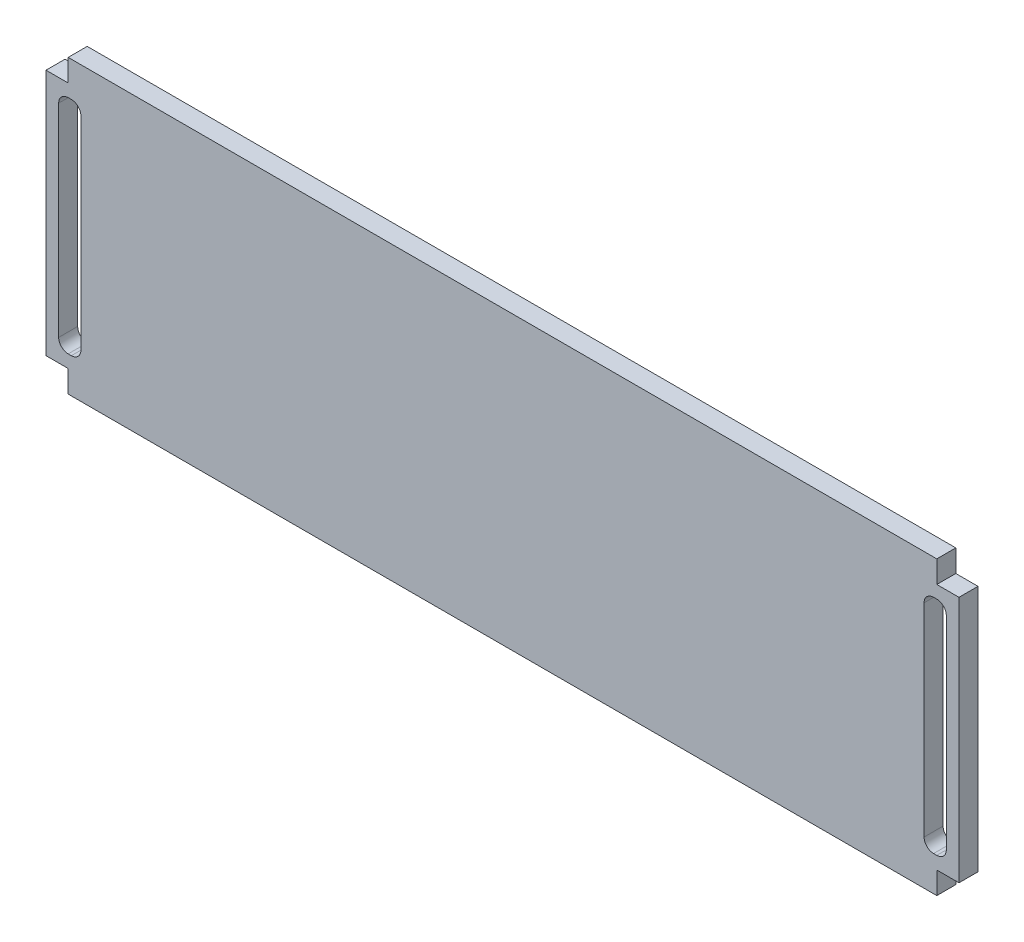
ISO-10303-21;
HEADER;
FILE_DESCRIPTION(('STEP AP214'),'2;1');
FILE_NAME('part.step','',(''),(''),'','','');
FILE_SCHEMA(('AUTOMOTIVE_DESIGN { 1 0 10303 214 1 1 1 1 }'));
ENDSEC;
DATA;
#1=APPLICATION_CONTEXT('core data for automotive mechanical design processes');
#2=APPLICATION_PROTOCOL_DEFINITION('international standard','automotive_design',2000,#1);
#3=PRODUCT_CONTEXT('',#1,'mechanical');
#4=PRODUCT('Part','Part','',(#3));
#5=PRODUCT_RELATED_PRODUCT_CATEGORY('part','',(#4));
#6=PRODUCT_DEFINITION_FORMATION('','',#4);
#7=PRODUCT_DEFINITION_CONTEXT('part definition',#1,'design');
#8=PRODUCT_DEFINITION('design','',#6,#7);
#9=PRODUCT_DEFINITION_SHAPE('','',#8);
#10=(LENGTH_UNIT() NAMED_UNIT(*) SI_UNIT(.MILLI.,.METRE.));
#11=(NAMED_UNIT(*) PLANE_ANGLE_UNIT() SI_UNIT($,.RADIAN.));
#12=(NAMED_UNIT(*) SI_UNIT($,.STERADIAN.) SOLID_ANGLE_UNIT());
#13=UNCERTAINTY_MEASURE_WITH_UNIT(LENGTH_MEASURE(1.E-05),#10,'distance_accuracy_value','');
#14=(GEOMETRIC_REPRESENTATION_CONTEXT(3) GLOBAL_UNCERTAINTY_ASSIGNED_CONTEXT((#13)) GLOBAL_UNIT_ASSIGNED_CONTEXT((#10,
#11,#12)) REPRESENTATION_CONTEXT('',''));
#15=CARTESIAN_POINT('',(0.,0.,0.));
#16=DIRECTION('',(0.,0.,1.));
#17=DIRECTION('',(1.,0.,0.));
#18=AXIS2_PLACEMENT_3D('',#15,#16,#17);
#19=CARTESIAN_POINT('',(72.,3.5,3.));
#20=DIRECTION('',(0.,1.,0.));
#21=DIRECTION('',(0.,0.,1.));
#22=AXIS2_PLACEMENT_3D('',#19,#20,#21);
#23=PLANE('',#22);
#24=DIRECTION('',(1.,0.,0.));
#25=VECTOR('',#24,1.);
#26=CARTESIAN_POINT('',(72.,3.5,0.));
#27=LINE('',#26,#25);
#28=CARTESIAN_POINT('',(68.5,3.5,0.));
#29=VERTEX_POINT('',#28);
#30=CARTESIAN_POINT('',(72.,3.5,0.));
#31=VERTEX_POINT('',#30);
#32=EDGE_CURVE('E247',#29,#31,#27,.T.);
#33=ORIENTED_EDGE('',*,*,#32,.T.);
#34=DIRECTION('',(0.,0.,-1.));
#35=VECTOR('',#34,1.);
#36=CARTESIAN_POINT('',(72.,3.5,3.));
#37=LINE('',#36,#35);
#38=CARTESIAN_POINT('',(72.,3.5,3.));
#39=VERTEX_POINT('',#38);
#40=EDGE_CURVE('E228',#39,#31,#37,.T.);
#41=ORIENTED_EDGE('',*,*,#40,.F.);
#42=DIRECTION('',(1.,0.,0.));
#43=VECTOR('',#42,1.);
#44=CARTESIAN_POINT('',(72.,3.5,3.));
#45=LINE('',#44,#43);
#46=CARTESIAN_POINT('',(68.5,3.5,3.));
#47=VERTEX_POINT('',#46);
#48=EDGE_CURVE('E235',#47,#39,#45,.T.);
#49=ORIENTED_EDGE('',*,*,#48,.F.);
#50=DIRECTION('',(0.,0.,-1.));
#51=VECTOR('',#50,1.);
#52=CARTESIAN_POINT('',(68.5,3.5,3.));
#53=LINE('',#52,#51);
#54=EDGE_CURVE('E370',#47,#29,#53,.T.);
#55=ORIENTED_EDGE('',*,*,#54,.T.);
#56=EDGE_LOOP('',(#33,#41,#49,#55));
#57=FACE_BOUND('',#56,.T.);
#58=ADVANCED_FACE('F39',(#57),#23,.F.);
#59=CARTESIAN_POINT('',(72.,42.5,3.));
#60=DIRECTION('',(-1.,0.,0.));
#61=DIRECTION('',(0.,-1.,0.));
#62=AXIS2_PLACEMENT_3D('',#59,#60,#61);
#63=PLANE('',#62);
#64=DIRECTION('',(0.,1.,0.));
#65=VECTOR('',#64,1.);
#66=CARTESIAN_POINT('',(72.,42.5,0.));
#67=LINE('',#66,#65);
#68=CARTESIAN_POINT('',(72.,42.5,0.));
#69=VERTEX_POINT('',#68);
#70=EDGE_CURVE('E372',#31,#69,#67,.T.);
#71=ORIENTED_EDGE('',*,*,#70,.T.);
#72=DIRECTION('',(0.,0.,-1.));
#73=VECTOR('',#72,1.);
#74=CARTESIAN_POINT('',(72.,42.5,3.));
#75=LINE('',#74,#73);
#76=CARTESIAN_POINT('',(72.,42.5,3.));
#77=VERTEX_POINT('',#76);
#78=EDGE_CURVE('E231',#77,#69,#75,.T.);
#79=ORIENTED_EDGE('',*,*,#78,.F.);
#80=DIRECTION('',(0.,1.,0.));
#81=VECTOR('',#80,1.);
#82=CARTESIAN_POINT('',(72.,42.5,3.));
#83=LINE('',#82,#81);
#84=EDGE_CURVE('E224',#39,#77,#83,.T.);
#85=ORIENTED_EDGE('',*,*,#84,.F.);
#86=ORIENTED_EDGE('',*,*,#40,.T.);
#87=EDGE_LOOP('',(#71,#79,#85,#86));
#88=FACE_BOUND('',#87,.T.);
#89=ADVANCED_FACE('F226',(#88),#63,.F.);
#90=CARTESIAN_POINT('',(68.5,42.5,3.));
#91=DIRECTION('',(0.,-1.,0.));
#92=DIRECTION('',(0.,0.,-1.));
#93=AXIS2_PLACEMENT_3D('',#90,#91,#92);
#94=PLANE('',#93);
#95=DIRECTION('',(-1.,0.,0.));
#96=VECTOR('',#95,1.);
#97=CARTESIAN_POINT('',(68.5,42.5,0.));
#98=LINE('',#97,#96);
#99=CARTESIAN_POINT('',(68.5,42.5,0.));
#100=VERTEX_POINT('',#99);
#101=EDGE_CURVE('E375',#69,#100,#98,.T.);
#102=ORIENTED_EDGE('',*,*,#101,.T.);
#103=DIRECTION('',(0.,0.,-1.));
#104=VECTOR('',#103,1.);
#105=CARTESIAN_POINT('',(68.5,42.5,3.));
#106=LINE('',#105,#104);
#107=CARTESIAN_POINT('',(68.5,42.5,3.));
#108=VERTEX_POINT('',#107);
#109=EDGE_CURVE('E252',#108,#100,#106,.T.);
#110=ORIENTED_EDGE('',*,*,#109,.F.);
#111=DIRECTION('',(-1.,0.,0.));
#112=VECTOR('',#111,1.);
#113=CARTESIAN_POINT('',(68.5,42.5,3.));
#114=LINE('',#113,#112);
#115=EDGE_CURVE('E234',#77,#108,#114,.T.);
#116=ORIENTED_EDGE('',*,*,#115,.F.);
#117=ORIENTED_EDGE('',*,*,#78,.T.);
#118=EDGE_LOOP('',(#102,#110,#116,#117));
#119=FACE_BOUND('',#118,.T.);
#120=ADVANCED_FACE('F440',(#119),#94,.F.);
#121=CARTESIAN_POINT('',(68.5,46.,3.));
#122=DIRECTION('',(-1.,0.,0.));
#123=DIRECTION('',(0.,0.,1.));
#124=AXIS2_PLACEMENT_3D('',#121,#122,#123);
#125=PLANE('',#124);
#126=DIRECTION('',(0.,1.,0.));
#127=VECTOR('',#126,1.);
#128=CARTESIAN_POINT('',(68.5,46.,0.));
#129=LINE('',#128,#127);
#130=CARTESIAN_POINT('',(68.5,46.,0.));
#131=VERTEX_POINT('',#130);
#132=EDGE_CURVE('E377',#100,#131,#129,.T.);
#133=ORIENTED_EDGE('',*,*,#132,.T.);
#134=DIRECTION('',(0.,0.,-1.));
#135=VECTOR('',#134,1.);
#136=CARTESIAN_POINT('',(68.5,46.,3.));
#137=LINE('',#136,#135);
#138=CARTESIAN_POINT('',(68.5,46.,3.));
#139=VERTEX_POINT('',#138);
#140=EDGE_CURVE('E416',#139,#131,#137,.T.);
#141=ORIENTED_EDGE('',*,*,#140,.F.);
#142=DIRECTION('',(0.,1.,0.));
#143=VECTOR('',#142,1.);
#144=CARTESIAN_POINT('',(68.5,46.,3.));
#145=LINE('',#144,#143);
#146=EDGE_CURVE('E353',#108,#139,#145,.T.);
#147=ORIENTED_EDGE('',*,*,#146,.F.);
#148=ORIENTED_EDGE('',*,*,#109,.T.);
#149=EDGE_LOOP('',(#133,#141,#147,#148));
#150=FACE_BOUND('',#149,.T.);
#151=ADVANCED_FACE('F423',(#150),#125,.F.);
#152=CARTESIAN_POINT('',(68.5,46.,3.));
#153=DIRECTION('',(0.,-1.,0.));
#154=DIRECTION('',(0.,0.,-1.));
#155=AXIS2_PLACEMENT_3D('',#152,#153,#154);
#156=PLANE('',#155);
#157=DIRECTION('',(-1.,0.,0.));
#158=VECTOR('',#157,1.);
#159=CARTESIAN_POINT('',(68.5,46.,0.));
#160=LINE('',#159,#158);
#161=CARTESIAN_POINT('',(-68.5,46.,0.));
#162=VERTEX_POINT('',#161);
#163=EDGE_CURVE('E379',#131,#162,#160,.T.);
#164=ORIENTED_EDGE('',*,*,#163,.T.);
#165=DIRECTION('',(0.,0.,-1.));
#166=VECTOR('',#165,1.);
#167=CARTESIAN_POINT('',(-68.5,46.,3.));
#168=LINE('',#167,#166);
#169=CARTESIAN_POINT('',(-68.5,46.,3.));
#170=VERTEX_POINT('',#169);
#171=EDGE_CURVE('E413',#170,#162,#168,.T.);
#172=ORIENTED_EDGE('',*,*,#171,.F.);
#173=DIRECTION('',(-1.,0.,0.));
#174=VECTOR('',#173,1.);
#175=CARTESIAN_POINT('',(68.5,46.,3.));
#176=LINE('',#175,#174);
#177=EDGE_CURVE('E355',#139,#170,#176,.T.);
#178=ORIENTED_EDGE('',*,*,#177,.F.);
#179=ORIENTED_EDGE('',*,*,#140,.T.);
#180=EDGE_LOOP('',(#164,#172,#178,#179));
#181=FACE_BOUND('',#180,.T.);
#182=ADVANCED_FACE('F432',(#181),#156,.F.);
#183=CARTESIAN_POINT('',(-68.5,46.,3.));
#184=DIRECTION('',(1.,0.,0.));
#185=DIRECTION('',(0.,0.,-1.));
#186=AXIS2_PLACEMENT_3D('',#183,#184,#185);
#187=PLANE('',#186);
#188=DIRECTION('',(0.,-1.,0.));
#189=VECTOR('',#188,1.);
#190=CARTESIAN_POINT('',(-68.5,46.,0.));
#191=LINE('',#190,#189);
#192=CARTESIAN_POINT('',(-68.5,42.5,0.));
#193=VERTEX_POINT('',#192);
#194=EDGE_CURVE('E381',#162,#193,#191,.T.);
#195=ORIENTED_EDGE('',*,*,#194,.T.);
#196=DIRECTION('',(0.,0.,-1.));
#197=VECTOR('',#196,1.);
#198=CARTESIAN_POINT('',(-68.5,42.5,3.));
#199=LINE('',#198,#197);
#200=CARTESIAN_POINT('',(-68.5,42.5,3.));
#201=VERTEX_POINT('',#200);
#202=EDGE_CURVE('E410',#201,#193,#199,.T.);
#203=ORIENTED_EDGE('',*,*,#202,.F.);
#204=DIRECTION('',(0.,-1.,0.));
#205=VECTOR('',#204,1.);
#206=CARTESIAN_POINT('',(-68.5,46.,3.));
#207=LINE('',#206,#205);
#208=EDGE_CURVE('E357',#170,#201,#207,.T.);
#209=ORIENTED_EDGE('',*,*,#208,.F.);
#210=ORIENTED_EDGE('',*,*,#171,.T.);
#211=EDGE_LOOP('',(#195,#203,#209,#210));
#212=FACE_BOUND('',#211,.T.);
#213=ADVANCED_FACE('F436',(#212),#187,.F.);
#214=CARTESIAN_POINT('',(-68.5,42.5,3.));
#215=DIRECTION('',(0.,-1.,0.));
#216=DIRECTION('',(0.,0.,-1.));
#217=AXIS2_PLACEMENT_3D('',#214,#215,#216);
#218=PLANE('',#217);
#219=DIRECTION('',(-1.,0.,0.));
#220=VECTOR('',#219,1.);
#221=CARTESIAN_POINT('',(-68.5,42.5,0.));
#222=LINE('',#221,#220);
#223=CARTESIAN_POINT('',(-72.,42.5,0.));
#224=VERTEX_POINT('',#223);
#225=EDGE_CURVE('E383',#193,#224,#222,.T.);
#226=ORIENTED_EDGE('',*,*,#225,.T.);
#227=DIRECTION('',(0.,0.,-1.));
#228=VECTOR('',#227,1.);
#229=CARTESIAN_POINT('',(-72.,42.5,3.));
#230=LINE('',#229,#228);
#231=CARTESIAN_POINT('',(-72.,42.5,3.));
#232=VERTEX_POINT('',#231);
#233=EDGE_CURVE('E407',#232,#224,#230,.T.);
#234=ORIENTED_EDGE('',*,*,#233,.F.);
#235=DIRECTION('',(-1.,0.,0.));
#236=VECTOR('',#235,1.);
#237=CARTESIAN_POINT('',(-68.5,42.5,3.));
#238=LINE('',#237,#236);
#239=EDGE_CURVE('E359',#201,#232,#238,.T.);
#240=ORIENTED_EDGE('',*,*,#239,.F.);
#241=ORIENTED_EDGE('',*,*,#202,.T.);
#242=EDGE_LOOP('',(#226,#234,#240,#241));
#243=FACE_BOUND('',#242,.T.);
#244=ADVANCED_FACE('F546',(#243),#218,.F.);
#245=CARTESIAN_POINT('',(-72.,42.5,3.));
#246=DIRECTION('',(1.,0.,0.));
#247=DIRECTION('',(0.,1.,0.));
#248=AXIS2_PLACEMENT_3D('',#245,#246,#247);
#249=PLANE('',#248);
#250=DIRECTION('',(0.,-1.,0.));
#251=VECTOR('',#250,1.);
#252=CARTESIAN_POINT('',(-72.,42.5,0.));
#253=LINE('',#252,#251);
#254=CARTESIAN_POINT('',(-72.,3.5,0.));
#255=VERTEX_POINT('',#254);
#256=EDGE_CURVE('E385',#224,#255,#253,.T.);
#257=ORIENTED_EDGE('',*,*,#256,.T.);
#258=DIRECTION('',(0.,0.,-1.));
#259=VECTOR('',#258,1.);
#260=CARTESIAN_POINT('',(-72.,3.5,3.));
#261=LINE('',#260,#259);
#262=CARTESIAN_POINT('',(-72.,3.5,3.));
#263=VERTEX_POINT('',#262);
#264=EDGE_CURVE('E404',#263,#255,#261,.T.);
#265=ORIENTED_EDGE('',*,*,#264,.F.);
#266=DIRECTION('',(0.,-1.,0.));
#267=VECTOR('',#266,1.);
#268=CARTESIAN_POINT('',(-72.,42.5,3.));
#269=LINE('',#268,#267);
#270=EDGE_CURVE('E361',#232,#263,#269,.T.);
#271=ORIENTED_EDGE('',*,*,#270,.F.);
#272=ORIENTED_EDGE('',*,*,#233,.T.);
#273=EDGE_LOOP('',(#257,#265,#271,#272));
#274=FACE_BOUND('',#273,.T.);
#275=ADVANCED_FACE('F542',(#274),#249,.F.);
#276=CARTESIAN_POINT('',(-72.,3.5,3.));
#277=DIRECTION('',(0.,1.,0.));
#278=DIRECTION('',(0.,0.,1.));
#279=AXIS2_PLACEMENT_3D('',#276,#277,#278);
#280=PLANE('',#279);
#281=DIRECTION('',(1.,0.,0.));
#282=VECTOR('',#281,1.);
#283=CARTESIAN_POINT('',(-72.,3.5,0.));
#284=LINE('',#283,#282);
#285=CARTESIAN_POINT('',(-68.5,3.5,0.));
#286=VERTEX_POINT('',#285);
#287=EDGE_CURVE('E387',#255,#286,#284,.T.);
#288=ORIENTED_EDGE('',*,*,#287,.T.);
#289=DIRECTION('',(0.,0.,-1.));
#290=VECTOR('',#289,1.);
#291=CARTESIAN_POINT('',(-68.5,3.5,3.));
#292=LINE('',#291,#290);
#293=CARTESIAN_POINT('',(-68.5,3.5,3.));
#294=VERTEX_POINT('',#293);
#295=EDGE_CURVE('E401',#294,#286,#292,.T.);
#296=ORIENTED_EDGE('',*,*,#295,.F.);
#297=DIRECTION('',(1.,0.,0.));
#298=VECTOR('',#297,1.);
#299=CARTESIAN_POINT('',(-72.,3.5,3.));
#300=LINE('',#299,#298);
#301=EDGE_CURVE('E363',#263,#294,#300,.T.);
#302=ORIENTED_EDGE('',*,*,#301,.F.);
#303=ORIENTED_EDGE('',*,*,#264,.T.);
#304=EDGE_LOOP('',(#288,#296,#302,#303));
#305=FACE_BOUND('',#304,.T.);
#306=ADVANCED_FACE('F538',(#305),#280,.F.);
#307=CARTESIAN_POINT('',(-68.5,3.5,3.));
#308=DIRECTION('',(1.,0.,0.));
#309=DIRECTION('',(0.,1.,0.));
#310=AXIS2_PLACEMENT_3D('',#307,#308,#309);
#311=PLANE('',#310);
#312=DIRECTION('',(0.,-1.,0.));
#313=VECTOR('',#312,1.);
#314=CARTESIAN_POINT('',(-68.5,3.5,0.));
#315=LINE('',#314,#313);
#316=CARTESIAN_POINT('',(-68.5,0.,0.));
#317=VERTEX_POINT('',#316);
#318=EDGE_CURVE('E389',#286,#317,#315,.T.);
#319=ORIENTED_EDGE('',*,*,#318,.T.);
#320=DIRECTION('',(0.,0.,-1.));
#321=VECTOR('',#320,1.);
#322=CARTESIAN_POINT('',(-68.5,0.,3.));
#323=LINE('',#322,#321);
#324=CARTESIAN_POINT('',(-68.5,0.,3.));
#325=VERTEX_POINT('',#324);
#326=EDGE_CURVE('E398',#325,#317,#323,.T.);
#327=ORIENTED_EDGE('',*,*,#326,.F.);
#328=DIRECTION('',(0.,-1.,0.));
#329=VECTOR('',#328,1.);
#330=CARTESIAN_POINT('',(-68.5,3.5,3.));
#331=LINE('',#330,#329);
#332=EDGE_CURVE('E365',#294,#325,#331,.T.);
#333=ORIENTED_EDGE('',*,*,#332,.F.);
#334=ORIENTED_EDGE('',*,*,#295,.T.);
#335=EDGE_LOOP('',(#319,#327,#333,#334));
#336=FACE_BOUND('',#335,.T.);
#337=ADVANCED_FACE('F534',(#336),#311,.F.);
#338=CARTESIAN_POINT('',(-68.5,0.,3.));
#339=DIRECTION('',(0.,1.,0.));
#340=DIRECTION('',(0.,0.,1.));
#341=AXIS2_PLACEMENT_3D('',#338,#339,#340);
#342=PLANE('',#341);
#343=DIRECTION('',(1.,0.,0.));
#344=VECTOR('',#343,1.);
#345=CARTESIAN_POINT('',(-68.5,0.,0.));
#346=LINE('',#345,#344);
#347=CARTESIAN_POINT('',(68.5,0.,0.));
#348=VERTEX_POINT('',#347);
#349=EDGE_CURVE('E391',#317,#348,#346,.T.);
#350=ORIENTED_EDGE('',*,*,#349,.T.);
#351=DIRECTION('',(0.,0.,-1.));
#352=VECTOR('',#351,1.);
#353=CARTESIAN_POINT('',(68.5,0.,3.));
#354=LINE('',#353,#352);
#355=CARTESIAN_POINT('',(68.5,0.,3.));
#356=VERTEX_POINT('',#355);
#357=EDGE_CURVE('E395',#356,#348,#354,.T.);
#358=ORIENTED_EDGE('',*,*,#357,.F.);
#359=DIRECTION('',(1.,0.,0.));
#360=VECTOR('',#359,1.);
#361=CARTESIAN_POINT('',(-68.5,0.,3.));
#362=LINE('',#361,#360);
#363=EDGE_CURVE('E367',#325,#356,#362,.T.);
#364=ORIENTED_EDGE('',*,*,#363,.F.);
#365=ORIENTED_EDGE('',*,*,#326,.T.);
#366=EDGE_LOOP('',(#350,#358,#364,#365));
#367=FACE_BOUND('',#366,.T.);
#368=ADVANCED_FACE('F530',(#367),#342,.F.);
#369=CARTESIAN_POINT('',(68.5,3.5,3.));
#370=DIRECTION('',(-1.,0.,0.));
#371=DIRECTION('',(0.,-1.,0.));
#372=AXIS2_PLACEMENT_3D('',#369,#370,#371);
#373=PLANE('',#372);
#374=DIRECTION('',(0.,1.,0.));
#375=VECTOR('',#374,1.);
#376=CARTESIAN_POINT('',(68.5,3.5,0.));
#377=LINE('',#376,#375);
#378=EDGE_CURVE('E244',#348,#29,#377,.T.);
#379=ORIENTED_EDGE('',*,*,#378,.T.);
#380=ORIENTED_EDGE('',*,*,#54,.F.);
#381=DIRECTION('',(0.,1.,0.));
#382=VECTOR('',#381,1.);
#383=CARTESIAN_POINT('',(68.5,3.5,3.));
#384=LINE('',#383,#382);
#385=EDGE_CURVE('E240',#356,#47,#384,.T.);
#386=ORIENTED_EDGE('',*,*,#385,.F.);
#387=ORIENTED_EDGE('',*,*,#357,.T.);
#388=EDGE_LOOP('',(#379,#380,#386,#387));
#389=FACE_BOUND('',#388,.T.);
#390=ADVANCED_FACE('F523',(#389),#373,.F.);
#391=CARTESIAN_POINT('',(0.,0.,3.));
#392=DIRECTION('',(0.,0.,1.));
#393=DIRECTION('',(1.,0.,0.));
#394=AXIS2_PLACEMENT_3D('',#391,#392,#393);
#395=PLANE('',#394);
#396=DIRECTION('',(0.,-1.,0.));
#397=VECTOR('',#396,1.);
#398=CARTESIAN_POINT('',(-70.,0.,3.));
#399=LINE('',#398,#397);
#400=CARTESIAN_POINT('',(-70.,39.,3.));
#401=VERTEX_POINT('',#400);
#402=CARTESIAN_POINT('',(-70.,7.,3.));
#403=VERTEX_POINT('',#402);
#404=EDGE_CURVE('E341',#401,#403,#399,.T.);
#405=ORIENTED_EDGE('',*,*,#404,.F.);
#406=CARTESIAN_POINT('',(-68.5,39.,3.));
#407=DIRECTION('',(0.,0.,1.));
#408=DIRECTION('',(1.,0.,0.));
#409=AXIS2_PLACEMENT_3D('',#406,#407,#408);
#410=CIRCLE('',#409,1.5);
#411=CARTESIAN_POINT('',(-68.5,40.5,3.));
#412=VERTEX_POINT('',#411);
#413=EDGE_CURVE('E304',#401,#412,#410,.F.);
#414=ORIENTED_EDGE('',*,*,#413,.T.);
#415=DIRECTION('',(-1.,0.,0.));
#416=VECTOR('',#415,1.);
#417=CARTESIAN_POINT('',(0.,40.5,3.));
#418=LINE('',#417,#416);
#419=CARTESIAN_POINT('',(-68.,40.5,3.));
#420=VERTEX_POINT('',#419);
#421=EDGE_CURVE('E687',#420,#412,#418,.T.);
#422=ORIENTED_EDGE('',*,*,#421,.F.);
#423=CARTESIAN_POINT('',(-68.,39.,3.));
#424=DIRECTION('',(0.,0.,1.));
#425=DIRECTION('',(1.,0.,0.));
#426=AXIS2_PLACEMENT_3D('',#423,#424,#425);
#427=CIRCLE('',#426,1.5);
#428=CARTESIAN_POINT('',(-66.5,39.,3.));
#429=VERTEX_POINT('',#428);
#430=EDGE_CURVE('E300',#420,#429,#427,.F.);
#431=ORIENTED_EDGE('',*,*,#430,.T.);
#432=DIRECTION('',(0.,-1.,0.));
#433=VECTOR('',#432,1.);
#434=CARTESIAN_POINT('',(-66.5,0.,3.));
#435=LINE('',#434,#433);
#436=CARTESIAN_POINT('',(-66.5,7.,3.));
#437=VERTEX_POINT('',#436);
#438=EDGE_CURVE('E674',#429,#437,#435,.T.);
#439=ORIENTED_EDGE('',*,*,#438,.T.);
#440=CARTESIAN_POINT('',(-68.,7.,3.));
#441=DIRECTION('',(0.,0.,1.));
#442=DIRECTION('',(1.,0.,0.));
#443=AXIS2_PLACEMENT_3D('',#440,#441,#442);
#444=CIRCLE('',#443,1.5);
#445=CARTESIAN_POINT('',(-68.,5.5,3.));
#446=VERTEX_POINT('',#445);
#447=EDGE_CURVE('E292',#437,#446,#444,.F.);
#448=ORIENTED_EDGE('',*,*,#447,.T.);
#449=DIRECTION('',(1.,0.,0.));
#450=VECTOR('',#449,1.);
#451=CARTESIAN_POINT('',(0.,5.5,3.));
#452=LINE('',#451,#450);
#453=CARTESIAN_POINT('',(-68.5,5.5,3.));
#454=VERTEX_POINT('',#453);
#455=EDGE_CURVE('E344',#454,#446,#452,.T.);
#456=ORIENTED_EDGE('',*,*,#455,.F.);
#457=CARTESIAN_POINT('',(-68.5,7.,3.));
#458=DIRECTION('',(0.,0.,1.));
#459=DIRECTION('',(1.,0.,0.));
#460=AXIS2_PLACEMENT_3D('',#457,#458,#459);
#461=CIRCLE('',#460,1.5);
#462=EDGE_CURVE('E296',#454,#403,#461,.F.);
#463=ORIENTED_EDGE('',*,*,#462,.T.);
#464=EDGE_LOOP('',(#405,#414,#422,#431,#439,#448,#456,#463));
#465=FACE_BOUND('',#464,.T.);
#466=DIRECTION('',(0.,1.,0.));
#467=VECTOR('',#466,1.);
#468=CARTESIAN_POINT('',(70.,0.,3.));
#469=LINE('',#468,#467);
#470=CARTESIAN_POINT('',(70.,7.,3.));
#471=VERTEX_POINT('',#470);
#472=CARTESIAN_POINT('',(70.,39.,3.));
#473=VERTEX_POINT('',#472);
#474=EDGE_CURVE('E320',#471,#473,#469,.T.);
#475=ORIENTED_EDGE('',*,*,#474,.F.);
#476=CARTESIAN_POINT('',(68.5,7.,3.));
#477=DIRECTION('',(0.,0.,1.));
#478=DIRECTION('',(1.,0.,0.));
#479=AXIS2_PLACEMENT_3D('',#476,#477,#478);
#480=CIRCLE('',#479,1.5);
#481=CARTESIAN_POINT('',(68.5,5.5,3.));
#482=VERTEX_POINT('',#481);
#483=EDGE_CURVE('E308',#471,#482,#480,.F.);
#484=ORIENTED_EDGE('',*,*,#483,.T.);
#485=DIRECTION('',(1.,0.,0.));
#486=VECTOR('',#485,1.);
#487=CARTESIAN_POINT('',(0.,5.5,3.));
#488=LINE('',#487,#486);
#489=CARTESIAN_POINT('',(68.,5.5,3.));
#490=VERTEX_POINT('',#489);
#491=EDGE_CURVE('E349',#490,#482,#488,.T.);
#492=ORIENTED_EDGE('',*,*,#491,.F.);
#493=CARTESIAN_POINT('',(68.,7.,3.));
#494=DIRECTION('',(0.,0.,1.));
#495=DIRECTION('',(1.,0.,0.));
#496=AXIS2_PLACEMENT_3D('',#493,#494,#495);
#497=CIRCLE('',#496,1.5);
#498=CARTESIAN_POINT('',(66.5,7.,3.));
#499=VERTEX_POINT('',#498);
#500=EDGE_CURVE('E312',#490,#499,#497,.F.);
#501=ORIENTED_EDGE('',*,*,#500,.T.);
#502=DIRECTION('',(0.,-1.,0.));
#503=VECTOR('',#502,1.);
#504=CARTESIAN_POINT('',(66.5,0.,3.));
#505=LINE('',#504,#503);
#506=CARTESIAN_POINT('',(66.5,39.,3.));
#507=VERTEX_POINT('',#506);
#508=EDGE_CURVE('E497',#507,#499,#505,.T.);
#509=ORIENTED_EDGE('',*,*,#508,.F.);
#510=CARTESIAN_POINT('',(68.,39.,3.));
#511=DIRECTION('',(0.,0.,1.));
#512=DIRECTION('',(1.,0.,0.));
#513=AXIS2_PLACEMENT_3D('',#510,#511,#512);
#514=CIRCLE('',#513,1.5);
#515=CARTESIAN_POINT('',(68.,40.5,3.));
#516=VERTEX_POINT('',#515);
#517=EDGE_CURVE('E54',#507,#516,#514,.F.);
#518=ORIENTED_EDGE('',*,*,#517,.T.);
#519=DIRECTION('',(-1.,0.,0.));
#520=VECTOR('',#519,1.);
#521=CARTESIAN_POINT('',(0.,40.5,3.));
#522=LINE('',#521,#520);
#523=CARTESIAN_POINT('',(68.5,40.5,3.));
#524=VERTEX_POINT('',#523);
#525=EDGE_CURVE('E321',#524,#516,#522,.T.);
#526=ORIENTED_EDGE('',*,*,#525,.F.);
#527=CARTESIAN_POINT('',(68.5,39.,3.));
#528=DIRECTION('',(0.,0.,1.));
#529=DIRECTION('',(1.,0.,0.));
#530=AXIS2_PLACEMENT_3D('',#527,#528,#529);
#531=CIRCLE('',#530,1.5);
#532=EDGE_CURVE('E47',#524,#473,#531,.F.);
#533=ORIENTED_EDGE('',*,*,#532,.T.);
#534=EDGE_LOOP('',(#475,#484,#492,#501,#509,#518,#526,#533));
#535=FACE_BOUND('',#534,.T.);
#536=ORIENTED_EDGE('',*,*,#48,.T.);
#537=ORIENTED_EDGE('',*,*,#84,.T.);
#538=ORIENTED_EDGE('',*,*,#115,.T.);
#539=ORIENTED_EDGE('',*,*,#146,.T.);
#540=ORIENTED_EDGE('',*,*,#177,.T.);
#541=ORIENTED_EDGE('',*,*,#208,.T.);
#542=ORIENTED_EDGE('',*,*,#239,.T.);
#543=ORIENTED_EDGE('',*,*,#270,.T.);
#544=ORIENTED_EDGE('',*,*,#301,.T.);
#545=ORIENTED_EDGE('',*,*,#332,.T.);
#546=ORIENTED_EDGE('',*,*,#363,.T.);
#547=ORIENTED_EDGE('',*,*,#385,.T.);
#548=EDGE_LOOP('',(#536,#537,#538,#539,#540,#541,#542,#543,#544,#545,#546,#547));
#549=FACE_BOUND('',#548,.T.);
#550=ADVANCED_FACE('F238',(#465,#535,#549),#395,.T.);
#551=CARTESIAN_POINT('',(0.,0.,0.));
#552=DIRECTION('',(0.,0.,1.));
#553=DIRECTION('',(1.,0.,0.));
#554=AXIS2_PLACEMENT_3D('',#551,#552,#553);
#555=PLANE('',#554);
#556=DIRECTION('',(1.,0.,0.));
#557=VECTOR('',#556,1.);
#558=CARTESIAN_POINT('',(0.,40.5,0.));
#559=LINE('',#558,#557);
#560=CARTESIAN_POINT('',(-68.5,40.5,0.));
#561=VERTEX_POINT('',#560);
#562=CARTESIAN_POINT('',(-68.,40.5,0.));
#563=VERTEX_POINT('',#562);
#564=EDGE_CURVE('E686',#561,#563,#559,.T.);
#565=ORIENTED_EDGE('',*,*,#564,.F.);
#566=CARTESIAN_POINT('',(-68.5,39.,0.));
#567=DIRECTION('',(0.,0.,1.));
#568=DIRECTION('',(1.,0.,0.));
#569=AXIS2_PLACEMENT_3D('',#566,#567,#568);
#570=CIRCLE('',#569,1.5);
#571=CARTESIAN_POINT('',(-70.,39.,0.));
#572=VERTEX_POINT('',#571);
#573=EDGE_CURVE('E306',#561,#572,#570,.T.);
#574=ORIENTED_EDGE('',*,*,#573,.T.);
#575=DIRECTION('',(0.,1.,0.));
#576=VECTOR('',#575,1.);
#577=CARTESIAN_POINT('',(-70.,0.,0.));
#578=LINE('',#577,#576);
#579=CARTESIAN_POINT('',(-70.,7.,0.));
#580=VERTEX_POINT('',#579);
#581=EDGE_CURVE('E690',#580,#572,#578,.T.);
#582=ORIENTED_EDGE('',*,*,#581,.F.);
#583=CARTESIAN_POINT('',(-68.5,7.,0.));
#584=DIRECTION('',(0.,0.,1.));
#585=DIRECTION('',(1.,0.,0.));
#586=AXIS2_PLACEMENT_3D('',#583,#584,#585);
#587=CIRCLE('',#586,1.5);
#588=CARTESIAN_POINT('',(-68.5,5.5,0.));
#589=VERTEX_POINT('',#588);
#590=EDGE_CURVE('E298',#580,#589,#587,.T.);
#591=ORIENTED_EDGE('',*,*,#590,.T.);
#592=DIRECTION('',(-1.,0.,0.));
#593=VECTOR('',#592,1.);
#594=CARTESIAN_POINT('',(0.,5.5,0.));
#595=LINE('',#594,#593);
#596=CARTESIAN_POINT('',(-68.,5.5,0.));
#597=VERTEX_POINT('',#596);
#598=EDGE_CURVE('E373',#597,#589,#595,.T.);
#599=ORIENTED_EDGE('',*,*,#598,.F.);
#600=CARTESIAN_POINT('',(-68.,7.,0.));
#601=DIRECTION('',(0.,0.,1.));
#602=DIRECTION('',(1.,0.,0.));
#603=AXIS2_PLACEMENT_3D('',#600,#601,#602);
#604=CIRCLE('',#603,1.5);
#605=CARTESIAN_POINT('',(-66.5,7.,0.));
#606=VERTEX_POINT('',#605);
#607=EDGE_CURVE('E294',#597,#606,#604,.T.);
#608=ORIENTED_EDGE('',*,*,#607,.T.);
#609=DIRECTION('',(0.,1.,0.));
#610=VECTOR('',#609,1.);
#611=CARTESIAN_POINT('',(-66.5,0.,0.));
#612=LINE('',#611,#610);
#613=CARTESIAN_POINT('',(-66.5,39.,0.));
#614=VERTEX_POINT('',#613);
#615=EDGE_CURVE('E681',#606,#614,#612,.T.);
#616=ORIENTED_EDGE('',*,*,#615,.T.);
#617=CARTESIAN_POINT('',(-68.,39.,0.));
#618=DIRECTION('',(0.,0.,1.));
#619=DIRECTION('',(1.,0.,0.));
#620=AXIS2_PLACEMENT_3D('',#617,#618,#619);
#621=CIRCLE('',#620,1.5);
#622=EDGE_CURVE('E302',#614,#563,#621,.T.);
#623=ORIENTED_EDGE('',*,*,#622,.T.);
#624=EDGE_LOOP('',(#565,#574,#582,#591,#599,#608,#616,#623));
#625=FACE_BOUND('',#624,.T.);
#626=DIRECTION('',(-1.,0.,0.));
#627=VECTOR('',#626,1.);
#628=CARTESIAN_POINT('',(0.,5.5,0.));
#629=LINE('',#628,#627);
#630=CARTESIAN_POINT('',(68.5,5.5,0.));
#631=VERTEX_POINT('',#630);
#632=CARTESIAN_POINT('',(68.,5.5,0.));
#633=VERTEX_POINT('',#632);
#634=EDGE_CURVE('E346',#631,#633,#629,.T.);
#635=ORIENTED_EDGE('',*,*,#634,.F.);
#636=CARTESIAN_POINT('',(68.5,7.,0.));
#637=DIRECTION('',(0.,0.,1.));
#638=DIRECTION('',(1.,0.,0.));
#639=AXIS2_PLACEMENT_3D('',#636,#637,#638);
#640=CIRCLE('',#639,1.5);
#641=CARTESIAN_POINT('',(70.,7.,0.));
#642=VERTEX_POINT('',#641);
#643=EDGE_CURVE('E310',#631,#642,#640,.T.);
#644=ORIENTED_EDGE('',*,*,#643,.T.);
#645=DIRECTION('',(0.,-1.,0.));
#646=VECTOR('',#645,1.);
#647=CARTESIAN_POINT('',(70.,0.,0.));
#648=LINE('',#647,#646);
#649=CARTESIAN_POINT('',(70.,39.,0.));
#650=VERTEX_POINT('',#649);
#651=EDGE_CURVE('E337',#650,#642,#648,.T.);
#652=ORIENTED_EDGE('',*,*,#651,.F.);
#653=CARTESIAN_POINT('',(68.5,39.,0.));
#654=DIRECTION('',(0.,0.,1.));
#655=DIRECTION('',(1.,0.,0.));
#656=AXIS2_PLACEMENT_3D('',#653,#654,#655);
#657=CIRCLE('',#656,1.5);
#658=CARTESIAN_POINT('',(68.5,40.5,0.));
#659=VERTEX_POINT('',#658);
#660=EDGE_CURVE('E11',#650,#659,#657,.T.);
#661=ORIENTED_EDGE('',*,*,#660,.T.);
#662=DIRECTION('',(1.,0.,0.));
#663=VECTOR('',#662,1.);
#664=CARTESIAN_POINT('',(0.,40.5,0.));
#665=LINE('',#664,#663);
#666=CARTESIAN_POINT('',(68.,40.5,0.));
#667=VERTEX_POINT('',#666);
#668=EDGE_CURVE('E335',#667,#659,#665,.T.);
#669=ORIENTED_EDGE('',*,*,#668,.F.);
#670=CARTESIAN_POINT('',(68.,39.,0.));
#671=DIRECTION('',(0.,0.,1.));
#672=DIRECTION('',(1.,0.,0.));
#673=AXIS2_PLACEMENT_3D('',#670,#671,#672);
#674=CIRCLE('',#673,1.5);
#675=CARTESIAN_POINT('',(66.5,39.,0.));
#676=VERTEX_POINT('',#675);
#677=EDGE_CURVE('E317',#667,#676,#674,.T.);
#678=ORIENTED_EDGE('',*,*,#677,.T.);
#679=DIRECTION('',(0.,1.,0.));
#680=VECTOR('',#679,1.);
#681=CARTESIAN_POINT('',(66.5,0.,0.));
#682=LINE('',#681,#680);
#683=CARTESIAN_POINT('',(66.5,7.,0.));
#684=VERTEX_POINT('',#683);
#685=EDGE_CURVE('E487',#684,#676,#682,.T.);
#686=ORIENTED_EDGE('',*,*,#685,.F.);
#687=CARTESIAN_POINT('',(68.,7.,0.));
#688=DIRECTION('',(0.,0.,1.));
#689=DIRECTION('',(1.,0.,0.));
#690=AXIS2_PLACEMENT_3D('',#687,#688,#689);
#691=CIRCLE('',#690,1.5);
#692=EDGE_CURVE('E314',#684,#633,#691,.T.);
#693=ORIENTED_EDGE('',*,*,#692,.T.);
#694=EDGE_LOOP('',(#635,#644,#652,#661,#669,#678,#686,#693));
#695=FACE_BOUND('',#694,.T.);
#696=ORIENTED_EDGE('',*,*,#32,.F.);
#697=ORIENTED_EDGE('',*,*,#378,.F.);
#698=ORIENTED_EDGE('',*,*,#349,.F.);
#699=ORIENTED_EDGE('',*,*,#318,.F.);
#700=ORIENTED_EDGE('',*,*,#287,.F.);
#701=ORIENTED_EDGE('',*,*,#256,.F.);
#702=ORIENTED_EDGE('',*,*,#225,.F.);
#703=ORIENTED_EDGE('',*,*,#194,.F.);
#704=ORIENTED_EDGE('',*,*,#163,.F.);
#705=ORIENTED_EDGE('',*,*,#132,.F.);
#706=ORIENTED_EDGE('',*,*,#101,.F.);
#707=ORIENTED_EDGE('',*,*,#70,.F.);
#708=EDGE_LOOP('',(#696,#697,#698,#699,#700,#701,#702,#703,#704,#705,#706,#707));
#709=FACE_BOUND('',#708,.T.);
#710=ADVANCED_FACE('F333',(#625,#695,#709),#555,.F.);
#711=CARTESIAN_POINT('',(70.,0.,-35.1745646739231));
#712=DIRECTION('',(1.,0.,0.));
#713=DIRECTION('',(0.,1.,0.));
#714=AXIS2_PLACEMENT_3D('',#711,#712,#713);
#715=PLANE('',#714);
#716=ORIENTED_EDGE('',*,*,#651,.T.);
#717=DIRECTION('',(0.,0.,1.));
#718=VECTOR('',#717,1.);
#719=CARTESIAN_POINT('',(70.,7.,3.));
#720=LINE('',#719,#718);
#721=EDGE_CURVE('E275',#642,#471,#720,.T.);
#722=ORIENTED_EDGE('',*,*,#721,.T.);
#723=ORIENTED_EDGE('',*,*,#474,.T.);
#724=DIRECTION('',(0.,0.,1.));
#725=VECTOR('',#724,1.);
#726=CARTESIAN_POINT('',(70.,39.,0.));
#727=LINE('',#726,#725);
#728=EDGE_CURVE('E273',#473,#650,#727,.F.);
#729=ORIENTED_EDGE('',*,*,#728,.T.);
#730=EDGE_LOOP('',(#716,#722,#723,#729));
#731=FACE_BOUND('',#730,.T.);
#732=ADVANCED_FACE('F324',(#731),#715,.F.);
#733=CARTESIAN_POINT('',(0.,5.5,-35.1745646739231));
#734=DIRECTION('',(0.,-1.,0.));
#735=DIRECTION('',(0.,0.,-1.));
#736=AXIS2_PLACEMENT_3D('',#733,#734,#735);
#737=PLANE('',#736);
#738=ORIENTED_EDGE('',*,*,#491,.T.);
#739=DIRECTION('',(0.,0.,1.));
#740=VECTOR('',#739,1.);
#741=CARTESIAN_POINT('',(68.5,5.5,0.));
#742=LINE('',#741,#740);
#743=EDGE_CURVE('E281',#482,#631,#742,.F.);
#744=ORIENTED_EDGE('',*,*,#743,.T.);
#745=ORIENTED_EDGE('',*,*,#634,.T.);
#746=DIRECTION('',(0.,0.,1.));
#747=VECTOR('',#746,1.);
#748=CARTESIAN_POINT('',(68.,5.5,3.));
#749=LINE('',#748,#747);
#750=EDGE_CURVE('E278',#633,#490,#749,.T.);
#751=ORIENTED_EDGE('',*,*,#750,.T.);
#752=EDGE_LOOP('',(#738,#744,#745,#751));
#753=FACE_BOUND('',#752,.T.);
#754=ADVANCED_FACE('F504',(#753),#737,.F.);
#755=CARTESIAN_POINT('',(66.5,0.,-35.1745646739231));
#756=DIRECTION('',(-1.,0.,0.));
#757=DIRECTION('',(0.,-1.,0.));
#758=AXIS2_PLACEMENT_3D('',#755,#756,#757);
#759=PLANE('',#758);
#760=ORIENTED_EDGE('',*,*,#508,.T.);
#761=DIRECTION('',(0.,0.,1.));
#762=VECTOR('',#761,1.);
#763=CARTESIAN_POINT('',(66.5,7.,0.));
#764=LINE('',#763,#762);
#765=EDGE_CURVE('E286',#499,#684,#764,.F.);
#766=ORIENTED_EDGE('',*,*,#765,.T.);
#767=ORIENTED_EDGE('',*,*,#685,.T.);
#768=DIRECTION('',(0.,0.,1.));
#769=VECTOR('',#768,1.);
#770=CARTESIAN_POINT('',(66.5,39.,3.));
#771=LINE('',#770,#769);
#772=EDGE_CURVE('E283',#676,#507,#771,.T.);
#773=ORIENTED_EDGE('',*,*,#772,.T.);
#774=EDGE_LOOP('',(#760,#766,#767,#773));
#775=FACE_BOUND('',#774,.T.);
#776=ADVANCED_FACE('F491',(#775),#759,.F.);
#777=CARTESIAN_POINT('',(0.,40.5,-35.1745646739231));
#778=DIRECTION('',(0.,1.,0.));
#779=DIRECTION('',(0.,0.,1.));
#780=AXIS2_PLACEMENT_3D('',#777,#778,#779);
#781=PLANE('',#780);
#782=ORIENTED_EDGE('',*,*,#525,.T.);
#783=DIRECTION('',(0.,0.,1.));
#784=VECTOR('',#783,1.);
#785=CARTESIAN_POINT('',(68.,40.5,0.));
#786=LINE('',#785,#784);
#787=EDGE_CURVE('E290',#516,#667,#786,.F.);
#788=ORIENTED_EDGE('',*,*,#787,.T.);
#789=ORIENTED_EDGE('',*,*,#668,.T.);
#790=DIRECTION('',(0.,0.,1.));
#791=VECTOR('',#790,1.);
#792=CARTESIAN_POINT('',(68.5,40.5,3.));
#793=LINE('',#792,#791);
#794=EDGE_CURVE('E288',#659,#524,#793,.T.);
#795=ORIENTED_EDGE('',*,*,#794,.T.);
#796=EDGE_LOOP('',(#782,#788,#789,#795));
#797=FACE_BOUND('',#796,.T.);
#798=ADVANCED_FACE('F339',(#797),#781,.F.);
#799=CARTESIAN_POINT('',(-70.,0.,-35.1745646739231));
#800=DIRECTION('',(-1.,0.,0.));
#801=DIRECTION('',(0.,-1.,0.));
#802=AXIS2_PLACEMENT_3D('',#799,#800,#801);
#803=PLANE('',#802);
#804=ORIENTED_EDGE('',*,*,#404,.T.);
#805=DIRECTION('',(0.,0.,1.));
#806=VECTOR('',#805,1.);
#807=CARTESIAN_POINT('',(-70.,7.,0.));
#808=LINE('',#807,#806);
#809=EDGE_CURVE('E266',#403,#580,#808,.F.);
#810=ORIENTED_EDGE('',*,*,#809,.T.);
#811=ORIENTED_EDGE('',*,*,#581,.T.);
#812=DIRECTION('',(0.,0.,1.));
#813=VECTOR('',#812,1.);
#814=CARTESIAN_POINT('',(-70.,39.,3.));
#815=LINE('',#814,#813);
#816=EDGE_CURVE('E263',#572,#401,#815,.T.);
#817=ORIENTED_EDGE('',*,*,#816,.T.);
#818=EDGE_LOOP('',(#804,#810,#811,#817));
#819=FACE_BOUND('',#818,.T.);
#820=ADVANCED_FACE('F516',(#819),#803,.F.);
#821=CARTESIAN_POINT('',(0.,40.5,-35.1745646739231));
#822=DIRECTION('',(0.,1.,0.));
#823=DIRECTION('',(0.,0.,1.));
#824=AXIS2_PLACEMENT_3D('',#821,#822,#823);
#825=PLANE('',#824);
#826=ORIENTED_EDGE('',*,*,#564,.T.);
#827=DIRECTION('',(0.,0.,1.));
#828=VECTOR('',#827,1.);
#829=CARTESIAN_POINT('',(-68.,40.5,-35.1745646739231));
#830=LINE('',#829,#828);
#831=EDGE_CURVE('E270',#563,#420,#830,.T.);
#832=ORIENTED_EDGE('',*,*,#831,.T.);
#833=ORIENTED_EDGE('',*,*,#421,.T.);
#834=DIRECTION('',(0.,0.,1.));
#835=VECTOR('',#834,1.);
#836=CARTESIAN_POINT('',(-68.5,40.5,0.));
#837=LINE('',#836,#835);
#838=EDGE_CURVE('E268',#412,#561,#837,.F.);
#839=ORIENTED_EDGE('',*,*,#838,.T.);
#840=EDGE_LOOP('',(#826,#832,#833,#839));
#841=FACE_BOUND('',#840,.T.);
#842=ADVANCED_FACE('F615',(#841),#825,.F.);
#843=CARTESIAN_POINT('',(-66.5,0.,-35.1745646739231));
#844=DIRECTION('',(-1.,0.,0.));
#845=DIRECTION('',(0.,-1.,0.));
#846=AXIS2_PLACEMENT_3D('',#843,#844,#845);
#847=PLANE('',#846);
#848=ORIENTED_EDGE('',*,*,#615,.F.);
#849=DIRECTION('',(0.,0.,1.));
#850=VECTOR('',#849,1.);
#851=CARTESIAN_POINT('',(-66.5,7.,-35.1745646739231));
#852=LINE('',#851,#850);
#853=EDGE_CURVE('E250',#606,#437,#852,.T.);
#854=ORIENTED_EDGE('',*,*,#853,.T.);
#855=ORIENTED_EDGE('',*,*,#438,.F.);
#856=DIRECTION('',(0.,0.,1.));
#857=VECTOR('',#856,1.);
#858=CARTESIAN_POINT('',(-66.5,39.,-35.1745646739231));
#859=LINE('',#858,#857);
#860=EDGE_CURVE('E248',#429,#614,#859,.F.);
#861=ORIENTED_EDGE('',*,*,#860,.T.);
#862=EDGE_LOOP('',(#848,#854,#855,#861));
#863=FACE_BOUND('',#862,.T.);
#864=ADVANCED_FACE('F622',(#863),#847,.T.);
#865=CARTESIAN_POINT('',(0.,5.5,-35.1745646739231));
#866=DIRECTION('',(0.,-1.,0.));
#867=DIRECTION('',(0.,0.,-1.));
#868=AXIS2_PLACEMENT_3D('',#865,#866,#867);
#869=PLANE('',#868);
#870=ORIENTED_EDGE('',*,*,#455,.T.);
#871=DIRECTION('',(0.,0.,1.));
#872=VECTOR('',#871,1.);
#873=CARTESIAN_POINT('',(-68.,5.5,-35.1745646739231));
#874=LINE('',#873,#872);
#875=EDGE_CURVE('E261',#446,#597,#874,.F.);
#876=ORIENTED_EDGE('',*,*,#875,.T.);
#877=ORIENTED_EDGE('',*,*,#598,.T.);
#878=DIRECTION('',(0.,0.,1.));
#879=VECTOR('',#878,1.);
#880=CARTESIAN_POINT('',(-68.5,5.5,3.));
#881=LINE('',#880,#879);
#882=EDGE_CURVE('E258',#589,#454,#881,.T.);
#883=ORIENTED_EDGE('',*,*,#882,.T.);
#884=EDGE_LOOP('',(#870,#876,#877,#883));
#885=FACE_BOUND('',#884,.T.);
#886=ADVANCED_FACE('F458',(#885),#869,.F.);
#887=CARTESIAN_POINT('',(-68.,7.,-35.1745646739231));
#888=DIRECTION('',(0.,0.,1.));
#889=DIRECTION('',(1.,0.,0.));
#890=AXIS2_PLACEMENT_3D('',#887,#888,#889);
#891=CYLINDRICAL_SURFACE('',#890,1.5);
#892=ORIENTED_EDGE('',*,*,#607,.F.);
#893=ORIENTED_EDGE('',*,*,#875,.F.);
#894=ORIENTED_EDGE('',*,*,#447,.F.);
#895=ORIENTED_EDGE('',*,*,#853,.F.);
#896=EDGE_LOOP('',(#892,#893,#894,#895));
#897=FACE_BOUND('',#896,.T.);
#898=ADVANCED_FACE('F454',(#897),#891,.F.);
#899=CARTESIAN_POINT('',(-68.5,7.,-35.1745646739231));
#900=DIRECTION('',(0.,0.,-1.));
#901=DIRECTION('',(-1.,0.,0.));
#902=AXIS2_PLACEMENT_3D('',#899,#900,#901);
#903=CYLINDRICAL_SURFACE('',#902,1.5);
#904=ORIENTED_EDGE('',*,*,#590,.F.);
#905=ORIENTED_EDGE('',*,*,#809,.F.);
#906=ORIENTED_EDGE('',*,*,#462,.F.);
#907=ORIENTED_EDGE('',*,*,#882,.F.);
#908=EDGE_LOOP('',(#904,#905,#906,#907));
#909=FACE_BOUND('',#908,.T.);
#910=ADVANCED_FACE('F457',(#909),#903,.F.);
#911=CARTESIAN_POINT('',(-68.,39.,-35.1745646739231));
#912=DIRECTION('',(0.,0.,1.));
#913=DIRECTION('',(1.,0.,0.));
#914=AXIS2_PLACEMENT_3D('',#911,#912,#913);
#915=CYLINDRICAL_SURFACE('',#914,1.5);
#916=ORIENTED_EDGE('',*,*,#622,.F.);
#917=ORIENTED_EDGE('',*,*,#860,.F.);
#918=ORIENTED_EDGE('',*,*,#430,.F.);
#919=ORIENTED_EDGE('',*,*,#831,.F.);
#920=EDGE_LOOP('',(#916,#917,#918,#919));
#921=FACE_BOUND('',#920,.T.);
#922=ADVANCED_FACE('F462',(#921),#915,.F.);
#923=CARTESIAN_POINT('',(-68.5,39.,-35.1745646739231));
#924=DIRECTION('',(0.,0.,-1.));
#925=DIRECTION('',(-1.,0.,0.));
#926=AXIS2_PLACEMENT_3D('',#923,#924,#925);
#927=CYLINDRICAL_SURFACE('',#926,1.5);
#928=ORIENTED_EDGE('',*,*,#573,.F.);
#929=ORIENTED_EDGE('',*,*,#838,.F.);
#930=ORIENTED_EDGE('',*,*,#413,.F.);
#931=ORIENTED_EDGE('',*,*,#816,.F.);
#932=EDGE_LOOP('',(#928,#929,#930,#931));
#933=FACE_BOUND('',#932,.T.);
#934=ADVANCED_FACE('F466',(#933),#927,.F.);
#935=CARTESIAN_POINT('',(68.5,7.,-35.1745646739231));
#936=DIRECTION('',(0.,0.,-1.));
#937=DIRECTION('',(-1.,0.,0.));
#938=AXIS2_PLACEMENT_3D('',#935,#936,#937);
#939=CYLINDRICAL_SURFACE('',#938,1.5);
#940=ORIENTED_EDGE('',*,*,#643,.F.);
#941=ORIENTED_EDGE('',*,*,#743,.F.);
#942=ORIENTED_EDGE('',*,*,#483,.F.);
#943=ORIENTED_EDGE('',*,*,#721,.F.);
#944=EDGE_LOOP('',(#940,#941,#942,#943));
#945=FACE_BOUND('',#944,.T.);
#946=ADVANCED_FACE('F470',(#945),#939,.F.);
#947=CARTESIAN_POINT('',(68.,7.,-35.1745646739231));
#948=DIRECTION('',(0.,0.,-1.));
#949=DIRECTION('',(-1.,0.,0.));
#950=AXIS2_PLACEMENT_3D('',#947,#948,#949);
#951=CYLINDRICAL_SURFACE('',#950,1.5);
#952=ORIENTED_EDGE('',*,*,#692,.F.);
#953=ORIENTED_EDGE('',*,*,#765,.F.);
#954=ORIENTED_EDGE('',*,*,#500,.F.);
#955=ORIENTED_EDGE('',*,*,#750,.F.);
#956=EDGE_LOOP('',(#952,#953,#954,#955));
#957=FACE_BOUND('',#956,.T.);
#958=ADVANCED_FACE('F474',(#957),#951,.F.);
#959=CARTESIAN_POINT('',(68.,39.,-35.1745646739231));
#960=DIRECTION('',(0.,0.,-1.));
#961=DIRECTION('',(-1.,0.,0.));
#962=AXIS2_PLACEMENT_3D('',#959,#960,#961);
#963=CYLINDRICAL_SURFACE('',#962,1.5);
#964=ORIENTED_EDGE('',*,*,#677,.F.);
#965=ORIENTED_EDGE('',*,*,#787,.F.);
#966=ORIENTED_EDGE('',*,*,#517,.F.);
#967=ORIENTED_EDGE('',*,*,#772,.F.);
#968=EDGE_LOOP('',(#964,#965,#966,#967));
#969=FACE_BOUND('',#968,.T.);
#970=ADVANCED_FACE('F477',(#969),#963,.F.);
#971=CARTESIAN_POINT('',(68.5,39.,-35.1745646739231));
#972=DIRECTION('',(0.,0.,-1.));
#973=DIRECTION('',(-1.,0.,0.));
#974=AXIS2_PLACEMENT_3D('',#971,#972,#973);
#975=CYLINDRICAL_SURFACE('',#974,1.5);
#976=ORIENTED_EDGE('',*,*,#660,.F.);
#977=ORIENTED_EDGE('',*,*,#728,.F.);
#978=ORIENTED_EDGE('',*,*,#532,.F.);
#979=ORIENTED_EDGE('',*,*,#794,.F.);
#980=EDGE_LOOP('',(#976,#977,#978,#979));
#981=FACE_BOUND('',#980,.T.);
#982=ADVANCED_FACE('F41',(#981),#975,.F.);
#983=CLOSED_SHELL('',(#58,#89,#120,#151,#182,#213,#244,#275,#306,#337,#368,#390,#550,#710,#732,
#754,#776,#798,#820,#842,#864,#886,#898,#910,#922,#934,#946,#958,#970,#982));
#984=MANIFOLD_SOLID_BREP('B2',#983);
#985=ADVANCED_BREP_SHAPE_REPRESENTATION('',(#18,#984),#14);
#986=SHAPE_DEFINITION_REPRESENTATION(#9,#985);
ENDSEC;
END-ISO-10303-21;
